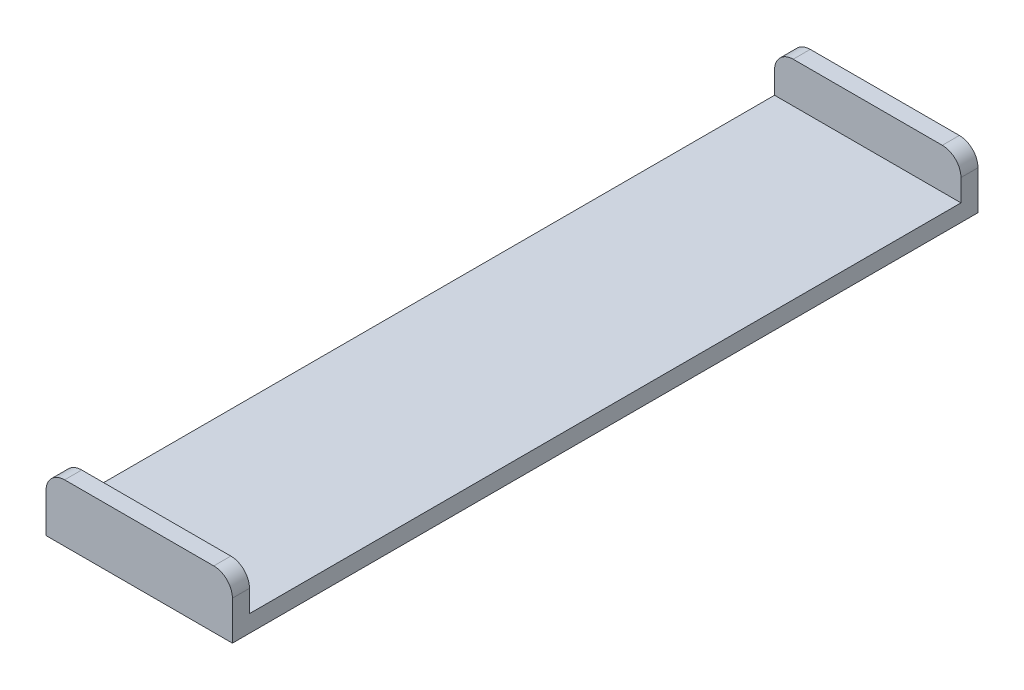
ISO-10303-21;
HEADER;
FILE_DESCRIPTION(('STEP AP214'),'2;1');
FILE_NAME('part.step','',(''),(''),'','','');
FILE_SCHEMA(('AUTOMOTIVE_DESIGN { 1 0 10303 214 1 1 1 1 }'));
ENDSEC;
DATA;
#1=APPLICATION_CONTEXT('core data for automotive mechanical design processes');
#2=APPLICATION_PROTOCOL_DEFINITION('international standard','automotive_design',2000,#1);
#3=PRODUCT_CONTEXT('',#1,'mechanical');
#4=PRODUCT('Part','Part','',(#3));
#5=PRODUCT_RELATED_PRODUCT_CATEGORY('part','',(#4));
#6=PRODUCT_DEFINITION_FORMATION('','',#4);
#7=PRODUCT_DEFINITION_CONTEXT('part definition',#1,'design');
#8=PRODUCT_DEFINITION('design','',#6,#7);
#9=PRODUCT_DEFINITION_SHAPE('','',#8);
#10=(LENGTH_UNIT() NAMED_UNIT(*) SI_UNIT(.MILLI.,.METRE.));
#11=(NAMED_UNIT(*) PLANE_ANGLE_UNIT() SI_UNIT($,.RADIAN.));
#12=(NAMED_UNIT(*) SI_UNIT($,.STERADIAN.) SOLID_ANGLE_UNIT());
#13=UNCERTAINTY_MEASURE_WITH_UNIT(LENGTH_MEASURE(1.E-05),#10,'distance_accuracy_value','');
#14=(GEOMETRIC_REPRESENTATION_CONTEXT(3) GLOBAL_UNCERTAINTY_ASSIGNED_CONTEXT((#13)) GLOBAL_UNIT_ASSIGNED_CONTEXT((#10,
#11,#12)) REPRESENTATION_CONTEXT('',''));
#15=CARTESIAN_POINT('',(0.,0.,0.));
#16=DIRECTION('',(0.,0.,1.));
#17=DIRECTION('',(1.,0.,0.));
#18=AXIS2_PLACEMENT_3D('',#15,#16,#17);
#19=CARTESIAN_POINT('',(0.,4.6482,0.));
#20=DIRECTION('',(0.,-1.,0.));
#21=DIRECTION('',(0.,0.,-1.));
#22=AXIS2_PLACEMENT_3D('',#19,#20,#21);
#23=PLANE('',#22);
#24=DIRECTION('',(1.,0.,0.));
#25=VECTOR('',#24,1.);
#26=CARTESIAN_POINT('',(0.,4.6482,-198.5518));
#27=LINE('',#26,#25);
#28=CARTESIAN_POINT('',(0.,4.6482,-198.5518));
#29=VERTEX_POINT('',#28);
#30=CARTESIAN_POINT('',(50.8,4.6482,-198.5518));
#31=VERTEX_POINT('',#30);
#32=EDGE_CURVE('E141',#29,#31,#27,.T.);
#33=ORIENTED_EDGE('',*,*,#32,.F.);
#34=DIRECTION('',(0.,0.,1.));
#35=VECTOR('',#34,1.);
#36=CARTESIAN_POINT('',(0.,4.6482,0.));
#37=LINE('',#36,#35);
#38=CARTESIAN_POINT('',(0.,4.6482,-4.6482));
#39=VERTEX_POINT('',#38);
#40=EDGE_CURVE('E126',#29,#39,#37,.T.);
#41=ORIENTED_EDGE('',*,*,#40,.T.);
#42=DIRECTION('',(-1.,0.,0.));
#43=VECTOR('',#42,1.);
#44=CARTESIAN_POINT('',(0.,4.6482,-4.6482));
#45=LINE('',#44,#43);
#46=CARTESIAN_POINT('',(50.8,4.6482,-4.6482));
#47=VERTEX_POINT('',#46);
#48=EDGE_CURVE('E138',#47,#39,#45,.T.);
#49=ORIENTED_EDGE('',*,*,#48,.F.);
#50=DIRECTION('',(0.,0.,-1.));
#51=VECTOR('',#50,1.);
#52=CARTESIAN_POINT('',(50.8,4.6482,0.));
#53=LINE('',#52,#51);
#54=EDGE_CURVE('E142',#47,#31,#53,.T.);
#55=ORIENTED_EDGE('',*,*,#54,.T.);
#56=EDGE_LOOP('',(#33,#41,#49,#55));
#57=FACE_BOUND('',#56,.T.);
#58=ADVANCED_FACE('F34',(#57),#23,.F.);
#59=CARTESIAN_POINT('',(0.,4.6482,0.));
#60=DIRECTION('',(1.,0.,0.));
#61=DIRECTION('',(0.,0.,-1.));
#62=AXIS2_PLACEMENT_3D('',#59,#60,#61);
#63=PLANE('',#62);
#64=DIRECTION('',(0.,-1.,0.));
#65=VECTOR('',#64,1.);
#66=CARTESIAN_POINT('',(0.,15.6972,-198.5518));
#67=LINE('',#66,#65);
#68=CARTESIAN_POINT('',(0.,10.6172,-198.5518));
#69=VERTEX_POINT('',#68);
#70=EDGE_CURVE('E148',#69,#29,#67,.T.);
#71=ORIENTED_EDGE('',*,*,#70,.F.);
#72=DIRECTION('',(0.,0.,1.));
#73=VECTOR('',#72,1.);
#74=CARTESIAN_POINT('',(0.,10.6172,-203.2));
#75=LINE('',#74,#73);
#76=CARTESIAN_POINT('',(0.,10.6172,-203.2));
#77=VERTEX_POINT('',#76);
#78=EDGE_CURVE('E196',#69,#77,#75,.F.);
#79=ORIENTED_EDGE('',*,*,#78,.T.);
#80=DIRECTION('',(0.,-1.,0.));
#81=VECTOR('',#80,1.);
#82=CARTESIAN_POINT('',(0.,4.6482,-203.2));
#83=LINE('',#82,#81);
#84=CARTESIAN_POINT('',(0.,0.,-203.2));
#85=VERTEX_POINT('',#84);
#86=EDGE_CURVE('E159',#77,#85,#83,.T.);
#87=ORIENTED_EDGE('',*,*,#86,.T.);
#88=DIRECTION('',(0.,0.,1.));
#89=VECTOR('',#88,1.);
#90=CARTESIAN_POINT('',(0.,0.,0.));
#91=LINE('',#90,#89);
#92=CARTESIAN_POINT('',(0.,0.,0.));
#93=VERTEX_POINT('',#92);
#94=EDGE_CURVE('E156',#85,#93,#91,.T.);
#95=ORIENTED_EDGE('',*,*,#94,.T.);
#96=DIRECTION('',(0.,-1.,0.));
#97=VECTOR('',#96,1.);
#98=CARTESIAN_POINT('',(0.,4.6482,0.));
#99=LINE('',#98,#97);
#100=CARTESIAN_POINT('',(0.,10.6172,0.));
#101=VERTEX_POINT('',#100);
#102=EDGE_CURVE('E175',#101,#93,#99,.T.);
#103=ORIENTED_EDGE('',*,*,#102,.F.);
#104=DIRECTION('',(0.,0.,1.));
#105=VECTOR('',#104,1.);
#106=CARTESIAN_POINT('',(0.,10.6172,0.));
#107=LINE('',#106,#105);
#108=CARTESIAN_POINT('',(0.,10.6172,-4.6482));
#109=VERTEX_POINT('',#108);
#110=EDGE_CURVE('E129',#101,#109,#107,.F.);
#111=ORIENTED_EDGE('',*,*,#110,.T.);
#112=DIRECTION('',(0.,-1.,0.));
#113=VECTOR('',#112,1.);
#114=CARTESIAN_POINT('',(0.,15.6972,-4.6482));
#115=LINE('',#114,#113);
#116=EDGE_CURVE('E122',#109,#39,#115,.T.);
#117=ORIENTED_EDGE('',*,*,#116,.T.);
#118=ORIENTED_EDGE('',*,*,#40,.F.);
#119=EDGE_LOOP('',(#71,#79,#87,#95,#103,#111,#117,#118));
#120=FACE_BOUND('',#119,.T.);
#121=ADVANCED_FACE('F125',(#120),#63,.F.);
#122=CARTESIAN_POINT('',(0.,4.6482,0.));
#123=DIRECTION('',(0.,0.,-1.));
#124=DIRECTION('',(-1.,0.,0.));
#125=AXIS2_PLACEMENT_3D('',#122,#123,#124);
#126=PLANE('',#125);
#127=DIRECTION('',(1.,0.,0.));
#128=VECTOR('',#127,1.);
#129=CARTESIAN_POINT('',(0.,15.6972,0.));
#130=LINE('',#129,#128);
#131=CARTESIAN_POINT('',(5.08,15.6972,0.));
#132=VERTEX_POINT('',#131);
#133=CARTESIAN_POINT('',(45.72,15.6972,0.));
#134=VERTEX_POINT('',#133);
#135=EDGE_CURVE('E147',#132,#134,#130,.T.);
#136=ORIENTED_EDGE('',*,*,#135,.F.);
#137=CARTESIAN_POINT('',(5.08,10.6172,0.));
#138=DIRECTION('',(0.,0.,-1.));
#139=DIRECTION('',(-1.,0.,0.));
#140=AXIS2_PLACEMENT_3D('',#137,#138,#139);
#141=CIRCLE('',#140,5.08);
#142=EDGE_CURVE('E205',#132,#101,#141,.F.);
#143=ORIENTED_EDGE('',*,*,#142,.T.);
#144=ORIENTED_EDGE('',*,*,#102,.T.);
#145=DIRECTION('',(1.,0.,0.));
#146=VECTOR('',#145,1.);
#147=CARTESIAN_POINT('',(0.,0.,0.));
#148=LINE('',#147,#146);
#149=CARTESIAN_POINT('',(50.8,0.,0.));
#150=VERTEX_POINT('',#149);
#151=EDGE_CURVE('E162',#93,#150,#148,.T.);
#152=ORIENTED_EDGE('',*,*,#151,.T.);
#153=DIRECTION('',(0.,-1.,0.));
#154=VECTOR('',#153,1.);
#155=CARTESIAN_POINT('',(50.8,4.6482,0.));
#156=LINE('',#155,#154);
#157=CARTESIAN_POINT('',(50.8,10.6172,0.));
#158=VERTEX_POINT('',#157);
#159=EDGE_CURVE('E173',#158,#150,#156,.T.);
#160=ORIENTED_EDGE('',*,*,#159,.F.);
#161=CARTESIAN_POINT('',(45.72,10.6172,0.));
#162=DIRECTION('',(0.,0.,-1.));
#163=DIRECTION('',(-1.,0.,0.));
#164=AXIS2_PLACEMENT_3D('',#161,#162,#163);
#165=CIRCLE('',#164,5.08);
#166=EDGE_CURVE('E203',#158,#134,#165,.F.);
#167=ORIENTED_EDGE('',*,*,#166,.T.);
#168=EDGE_LOOP('',(#136,#143,#144,#152,#160,#167));
#169=FACE_BOUND('',#168,.T.);
#170=ADVANCED_FACE('F213',(#169),#126,.F.);
#171=CARTESIAN_POINT('',(50.8,4.6482,0.));
#172=DIRECTION('',(-1.,0.,0.));
#173=DIRECTION('',(0.,0.,1.));
#174=AXIS2_PLACEMENT_3D('',#171,#172,#173);
#175=PLANE('',#174);
#176=DIRECTION('',(0.,-1.,0.));
#177=VECTOR('',#176,1.);
#178=CARTESIAN_POINT('',(50.8,4.6482,-203.2));
#179=LINE('',#178,#177);
#180=CARTESIAN_POINT('',(50.8,10.6172,-203.2));
#181=VERTEX_POINT('',#180);
#182=CARTESIAN_POINT('',(50.8,0.,-203.2));
#183=VERTEX_POINT('',#182);
#184=EDGE_CURVE('E171',#181,#183,#179,.T.);
#185=ORIENTED_EDGE('',*,*,#184,.F.);
#186=DIRECTION('',(0.,0.,-1.));
#187=VECTOR('',#186,1.);
#188=CARTESIAN_POINT('',(50.8,10.6172,-198.5518));
#189=LINE('',#188,#187);
#190=CARTESIAN_POINT('',(50.8,10.6172,-198.5518));
#191=VERTEX_POINT('',#190);
#192=EDGE_CURVE('E189',#181,#191,#189,.F.);
#193=ORIENTED_EDGE('',*,*,#192,.T.);
#194=DIRECTION('',(0.,-1.,0.));
#195=VECTOR('',#194,1.);
#196=CARTESIAN_POINT('',(50.8,15.6972,-198.5518));
#197=LINE('',#196,#195);
#198=EDGE_CURVE('E152',#191,#31,#197,.T.);
#199=ORIENTED_EDGE('',*,*,#198,.T.);
#200=ORIENTED_EDGE('',*,*,#54,.F.);
#201=DIRECTION('',(0.,-1.,0.));
#202=VECTOR('',#201,1.);
#203=CARTESIAN_POINT('',(50.8,15.6972,-4.6482));
#204=LINE('',#203,#202);
#205=CARTESIAN_POINT('',(50.8,10.6172,-4.6482));
#206=VERTEX_POINT('',#205);
#207=EDGE_CURVE('E131',#206,#47,#204,.T.);
#208=ORIENTED_EDGE('',*,*,#207,.F.);
#209=DIRECTION('',(0.,0.,-1.));
#210=VECTOR('',#209,1.);
#211=CARTESIAN_POINT('',(50.8,10.6172,0.));
#212=LINE('',#211,#210);
#213=EDGE_CURVE('E187',#206,#158,#212,.F.);
#214=ORIENTED_EDGE('',*,*,#213,.T.);
#215=ORIENTED_EDGE('',*,*,#159,.T.);
#216=DIRECTION('',(0.,0.,-1.));
#217=VECTOR('',#216,1.);
#218=CARTESIAN_POINT('',(50.8,0.,0.));
#219=LINE('',#218,#217);
#220=EDGE_CURVE('E165',#150,#183,#219,.T.);
#221=ORIENTED_EDGE('',*,*,#220,.T.);
#222=EDGE_LOOP('',(#185,#193,#199,#200,#208,#214,#215,#221));
#223=FACE_BOUND('',#222,.T.);
#224=ADVANCED_FACE('F208',(#223),#175,.F.);
#225=CARTESIAN_POINT('',(0.,4.6482,-203.2));
#226=DIRECTION('',(0.,0.,1.));
#227=DIRECTION('',(1.,0.,0.));
#228=AXIS2_PLACEMENT_3D('',#225,#226,#227);
#229=PLANE('',#228);
#230=DIRECTION('',(-1.,0.,0.));
#231=VECTOR('',#230,1.);
#232=CARTESIAN_POINT('',(0.,15.6972,-203.2));
#233=LINE('',#232,#231);
#234=CARTESIAN_POINT('',(45.72,15.6972,-203.2));
#235=VERTEX_POINT('',#234);
#236=CARTESIAN_POINT('',(5.08,15.6972,-203.2));
#237=VERTEX_POINT('',#236);
#238=EDGE_CURVE('E243',#235,#237,#233,.T.);
#239=ORIENTED_EDGE('',*,*,#238,.F.);
#240=CARTESIAN_POINT('',(45.72,10.6172,-203.2));
#241=DIRECTION('',(0.,0.,1.));
#242=DIRECTION('',(1.,0.,0.));
#243=AXIS2_PLACEMENT_3D('',#240,#241,#242);
#244=CIRCLE('',#243,5.08);
#245=EDGE_CURVE('E185',#235,#181,#244,.F.);
#246=ORIENTED_EDGE('',*,*,#245,.T.);
#247=ORIENTED_EDGE('',*,*,#184,.T.);
#248=DIRECTION('',(-1.,0.,0.));
#249=VECTOR('',#248,1.);
#250=CARTESIAN_POINT('',(0.,0.,-203.2));
#251=LINE('',#250,#249);
#252=EDGE_CURVE('E143',#183,#85,#251,.T.);
#253=ORIENTED_EDGE('',*,*,#252,.T.);
#254=ORIENTED_EDGE('',*,*,#86,.F.);
#255=CARTESIAN_POINT('',(5.08,10.6172,-203.2));
#256=DIRECTION('',(0.,0.,1.));
#257=DIRECTION('',(1.,0.,0.));
#258=AXIS2_PLACEMENT_3D('',#255,#256,#257);
#259=CIRCLE('',#258,5.08);
#260=EDGE_CURVE('E183',#77,#237,#259,.F.);
#261=ORIENTED_EDGE('',*,*,#260,.T.);
#262=EDGE_LOOP('',(#239,#246,#247,#253,#254,#261));
#263=FACE_BOUND('',#262,.T.);
#264=ADVANCED_FACE('F252',(#263),#229,.F.);
#265=CARTESIAN_POINT('',(0.,0.,0.));
#266=DIRECTION('',(0.,-1.,0.));
#267=DIRECTION('',(0.,0.,-1.));
#268=AXIS2_PLACEMENT_3D('',#265,#266,#267);
#269=PLANE('',#268);
#270=ORIENTED_EDGE('',*,*,#94,.F.);
#271=ORIENTED_EDGE('',*,*,#252,.F.);
#272=ORIENTED_EDGE('',*,*,#220,.F.);
#273=ORIENTED_EDGE('',*,*,#151,.F.);
#274=EDGE_LOOP('',(#270,#271,#272,#273));
#275=FACE_BOUND('',#274,.T.);
#276=ADVANCED_FACE('F224',(#275),#269,.T.);
#277=CARTESIAN_POINT('',(0.,15.6972,-4.6482));
#278=DIRECTION('',(0.,0.,1.));
#279=DIRECTION('',(1.,0.,0.));
#280=AXIS2_PLACEMENT_3D('',#277,#278,#279);
#281=PLANE('',#280);
#282=ORIENTED_EDGE('',*,*,#116,.F.);
#283=CARTESIAN_POINT('',(5.08,10.6172,-4.6482));
#284=DIRECTION('',(0.,0.,1.));
#285=DIRECTION('',(1.,0.,0.));
#286=AXIS2_PLACEMENT_3D('',#283,#284,#285);
#287=CIRCLE('',#286,5.08);
#288=CARTESIAN_POINT('',(5.08,15.6972,-4.6482));
#289=VERTEX_POINT('',#288);
#290=EDGE_CURVE('E11',#109,#289,#287,.F.);
#291=ORIENTED_EDGE('',*,*,#290,.T.);
#292=DIRECTION('',(-1.,0.,0.));
#293=VECTOR('',#292,1.);
#294=CARTESIAN_POINT('',(0.,15.6972,-4.6482));
#295=LINE('',#294,#293);
#296=CARTESIAN_POINT('',(45.72,15.6972,-4.6482));
#297=VERTEX_POINT('',#296);
#298=EDGE_CURVE('E132',#297,#289,#295,.T.);
#299=ORIENTED_EDGE('',*,*,#298,.F.);
#300=CARTESIAN_POINT('',(45.72,10.6172,-4.6482));
#301=DIRECTION('',(0.,0.,1.));
#302=DIRECTION('',(1.,0.,0.));
#303=AXIS2_PLACEMENT_3D('',#300,#301,#302);
#304=CIRCLE('',#303,5.08);
#305=EDGE_CURVE('E42',#297,#206,#304,.F.);
#306=ORIENTED_EDGE('',*,*,#305,.T.);
#307=ORIENTED_EDGE('',*,*,#207,.T.);
#308=ORIENTED_EDGE('',*,*,#48,.T.);
#309=EDGE_LOOP('',(#282,#291,#299,#306,#307,#308));
#310=FACE_BOUND('',#309,.T.);
#311=ADVANCED_FACE('F145',(#310),#281,.F.);
#312=CARTESIAN_POINT('',(0.,15.6972,0.));
#313=DIRECTION('',(0.,-1.,0.));
#314=DIRECTION('',(0.,0.,-1.));
#315=AXIS2_PLACEMENT_3D('',#312,#313,#314);
#316=PLANE('',#315);
#317=ORIENTED_EDGE('',*,*,#298,.T.);
#318=DIRECTION('',(0.,0.,1.));
#319=VECTOR('',#318,1.);
#320=CARTESIAN_POINT('',(5.08,15.6972,0.));
#321=LINE('',#320,#319);
#322=EDGE_CURVE('E200',#289,#132,#321,.T.);
#323=ORIENTED_EDGE('',*,*,#322,.T.);
#324=ORIENTED_EDGE('',*,*,#135,.T.);
#325=DIRECTION('',(0.,0.,-1.));
#326=VECTOR('',#325,1.);
#327=CARTESIAN_POINT('',(45.72,15.6972,0.));
#328=LINE('',#327,#326);
#329=EDGE_CURVE('E198',#134,#297,#328,.T.);
#330=ORIENTED_EDGE('',*,*,#329,.T.);
#331=EDGE_LOOP('',(#317,#323,#324,#330));
#332=FACE_BOUND('',#331,.T.);
#333=ADVANCED_FACE('F215',(#332),#316,.F.);
#334=CARTESIAN_POINT('',(0.,15.6972,-198.5518));
#335=DIRECTION('',(0.,0.,-1.));
#336=DIRECTION('',(-1.,0.,0.));
#337=AXIS2_PLACEMENT_3D('',#334,#335,#336);
#338=PLANE('',#337);
#339=ORIENTED_EDGE('',*,*,#198,.F.);
#340=CARTESIAN_POINT('',(45.72,10.6172,-198.5518));
#341=DIRECTION('',(0.,0.,-1.));
#342=DIRECTION('',(-1.,0.,0.));
#343=AXIS2_PLACEMENT_3D('',#340,#341,#342);
#344=CIRCLE('',#343,5.08);
#345=CARTESIAN_POINT('',(45.72,15.6972,-198.5518));
#346=VERTEX_POINT('',#345);
#347=EDGE_CURVE('E193',#191,#346,#344,.F.);
#348=ORIENTED_EDGE('',*,*,#347,.T.);
#349=DIRECTION('',(1.,0.,0.));
#350=VECTOR('',#349,1.);
#351=CARTESIAN_POINT('',(0.,15.6972,-198.5518));
#352=LINE('',#351,#350);
#353=CARTESIAN_POINT('',(5.08,15.6972,-198.5518));
#354=VERTEX_POINT('',#353);
#355=EDGE_CURVE('E237',#354,#346,#352,.T.);
#356=ORIENTED_EDGE('',*,*,#355,.F.);
#357=CARTESIAN_POINT('',(5.08,10.6172,-198.5518));
#358=DIRECTION('',(0.,0.,-1.));
#359=DIRECTION('',(-1.,0.,0.));
#360=AXIS2_PLACEMENT_3D('',#357,#358,#359);
#361=CIRCLE('',#360,5.08);
#362=EDGE_CURVE('E191',#354,#69,#361,.F.);
#363=ORIENTED_EDGE('',*,*,#362,.T.);
#364=ORIENTED_EDGE('',*,*,#70,.T.);
#365=ORIENTED_EDGE('',*,*,#32,.T.);
#366=EDGE_LOOP('',(#339,#348,#356,#363,#364,#365));
#367=FACE_BOUND('',#366,.T.);
#368=ADVANCED_FACE('F236',(#367),#338,.F.);
#369=CARTESIAN_POINT('',(0.,15.6972,0.));
#370=DIRECTION('',(0.,1.,0.));
#371=DIRECTION('',(0.,0.,1.));
#372=AXIS2_PLACEMENT_3D('',#369,#370,#371);
#373=PLANE('',#372);
#374=ORIENTED_EDGE('',*,*,#355,.T.);
#375=DIRECTION('',(0.,0.,-1.));
#376=VECTOR('',#375,1.);
#377=CARTESIAN_POINT('',(45.72,15.6972,-203.2));
#378=LINE('',#377,#376);
#379=EDGE_CURVE('E180',#346,#235,#378,.T.);
#380=ORIENTED_EDGE('',*,*,#379,.T.);
#381=ORIENTED_EDGE('',*,*,#238,.T.);
#382=DIRECTION('',(0.,0.,1.));
#383=VECTOR('',#382,1.);
#384=CARTESIAN_POINT('',(5.08,15.6972,-198.5518));
#385=LINE('',#384,#383);
#386=EDGE_CURVE('E177',#237,#354,#385,.T.);
#387=ORIENTED_EDGE('',*,*,#386,.T.);
#388=EDGE_LOOP('',(#374,#380,#381,#387));
#389=FACE_BOUND('',#388,.T.);
#390=ADVANCED_FACE('F239',(#389),#373,.T.);
#391=CARTESIAN_POINT('',(45.72,10.6172,0.));
#392=DIRECTION('',(0.,0.,1.));
#393=DIRECTION('',(1.,0.,0.));
#394=AXIS2_PLACEMENT_3D('',#391,#392,#393);
#395=CYLINDRICAL_SURFACE('',#394,5.08);
#396=ORIENTED_EDGE('',*,*,#347,.F.);
#397=ORIENTED_EDGE('',*,*,#192,.F.);
#398=ORIENTED_EDGE('',*,*,#245,.F.);
#399=ORIENTED_EDGE('',*,*,#379,.F.);
#400=EDGE_LOOP('',(#396,#397,#398,#399));
#401=FACE_BOUND('',#400,.T.);
#402=ADVANCED_FACE('F231',(#401),#395,.T.);
#403=CARTESIAN_POINT('',(5.08,10.6172,0.));
#404=DIRECTION('',(0.,0.,-1.));
#405=DIRECTION('',(-1.,0.,0.));
#406=AXIS2_PLACEMENT_3D('',#403,#404,#405);
#407=CYLINDRICAL_SURFACE('',#406,5.08);
#408=ORIENTED_EDGE('',*,*,#260,.F.);
#409=ORIENTED_EDGE('',*,*,#78,.F.);
#410=ORIENTED_EDGE('',*,*,#362,.F.);
#411=ORIENTED_EDGE('',*,*,#386,.F.);
#412=EDGE_LOOP('',(#408,#409,#410,#411));
#413=FACE_BOUND('',#412,.T.);
#414=ADVANCED_FACE('F251',(#413),#407,.T.);
#415=CARTESIAN_POINT('',(5.08,10.6172,0.));
#416=DIRECTION('',(0.,0.,1.));
#417=DIRECTION('',(1.,0.,0.));
#418=AXIS2_PLACEMENT_3D('',#415,#416,#417);
#419=CYLINDRICAL_SURFACE('',#418,5.08);
#420=ORIENTED_EDGE('',*,*,#290,.F.);
#421=ORIENTED_EDGE('',*,*,#110,.F.);
#422=ORIENTED_EDGE('',*,*,#142,.F.);
#423=ORIENTED_EDGE('',*,*,#322,.F.);
#424=EDGE_LOOP('',(#420,#421,#422,#423));
#425=FACE_BOUND('',#424,.T.);
#426=ADVANCED_FACE('F218',(#425),#419,.T.);
#427=CARTESIAN_POINT('',(45.72,10.6172,0.));
#428=DIRECTION('',(0.,0.,-1.));
#429=DIRECTION('',(-1.,0.,0.));
#430=AXIS2_PLACEMENT_3D('',#427,#428,#429);
#431=CYLINDRICAL_SURFACE('',#430,5.08);
#432=ORIENTED_EDGE('',*,*,#166,.F.);
#433=ORIENTED_EDGE('',*,*,#213,.F.);
#434=ORIENTED_EDGE('',*,*,#305,.F.);
#435=ORIENTED_EDGE('',*,*,#329,.F.);
#436=EDGE_LOOP('',(#432,#433,#434,#435));
#437=FACE_BOUND('',#436,.T.);
#438=ADVANCED_FACE('F36',(#437),#431,.T.);
#439=CLOSED_SHELL('',(#58,#121,#170,#224,#264,#276,#311,#333,#368,#390,#402,#414,#426,#438));
#440=MANIFOLD_SOLID_BREP('B2',#439);
#441=ADVANCED_BREP_SHAPE_REPRESENTATION('',(#18,#440),#14);
#442=SHAPE_DEFINITION_REPRESENTATION(#9,#441);
ENDSEC;
END-ISO-10303-21;
